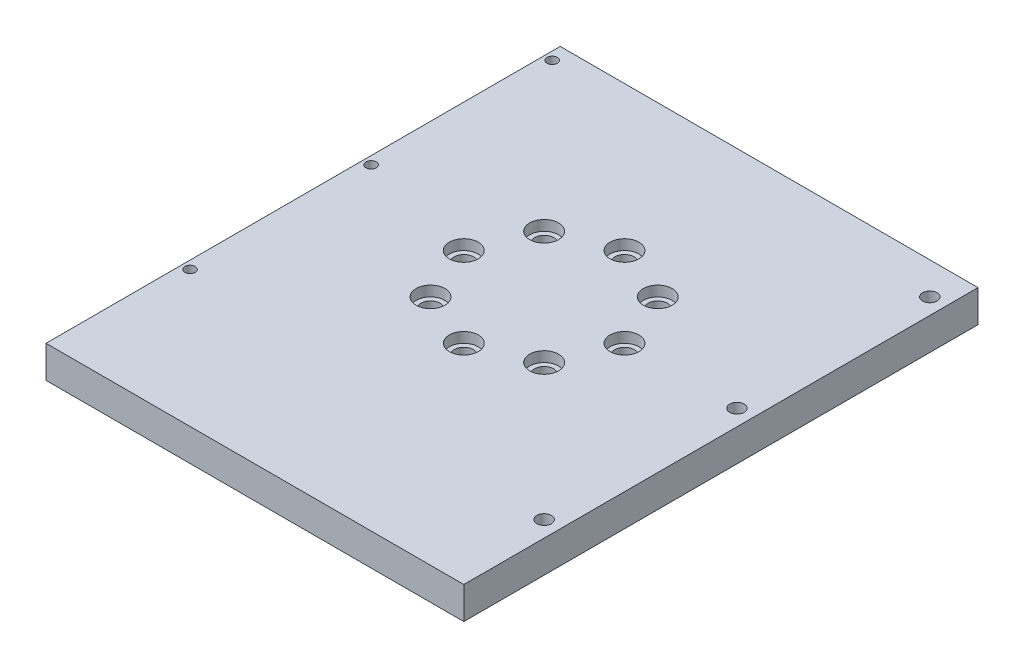
ISO-10303-21;
HEADER;
FILE_DESCRIPTION(('STEP AP214'),'2;1');
FILE_NAME('part.step','',(''),(''),'','','');
FILE_SCHEMA(('AUTOMOTIVE_DESIGN { 1 0 10303 214 1 1 1 1 }'));
ENDSEC;
DATA;
#1=APPLICATION_CONTEXT('core data for automotive mechanical design processes');
#2=APPLICATION_PROTOCOL_DEFINITION('international standard','automotive_design',2000,#1);
#3=PRODUCT_CONTEXT('',#1,'mechanical');
#4=PRODUCT('Part','Part','',(#3));
#5=PRODUCT_RELATED_PRODUCT_CATEGORY('part','',(#4));
#6=PRODUCT_DEFINITION_FORMATION('','',#4);
#7=PRODUCT_DEFINITION_CONTEXT('part definition',#1,'design');
#8=PRODUCT_DEFINITION('design','',#6,#7);
#9=PRODUCT_DEFINITION_SHAPE('','',#8);
#10=(LENGTH_UNIT() NAMED_UNIT(*) SI_UNIT(.MILLI.,.METRE.));
#11=(NAMED_UNIT(*) PLANE_ANGLE_UNIT() SI_UNIT($,.RADIAN.));
#12=(NAMED_UNIT(*) SI_UNIT($,.STERADIAN.) SOLID_ANGLE_UNIT());
#13=UNCERTAINTY_MEASURE_WITH_UNIT(LENGTH_MEASURE(1.E-05),#10,'distance_accuracy_value','');
#14=(GEOMETRIC_REPRESENTATION_CONTEXT(3) GLOBAL_UNCERTAINTY_ASSIGNED_CONTEXT((#13)) GLOBAL_UNIT_ASSIGNED_CONTEXT((#10,
#11,#12)) REPRESENTATION_CONTEXT('',''));
#15=CARTESIAN_POINT('',(0.,0.,0.));
#16=DIRECTION('',(0.,0.,1.));
#17=DIRECTION('',(1.,0.,0.));
#18=AXIS2_PLACEMENT_3D('',#15,#16,#17);
#19=CARTESIAN_POINT('',(0.,0.,0.));
#20=DIRECTION('',(0.,1.,0.));
#21=DIRECTION('',(0.,0.,1.));
#22=AXIS2_PLACEMENT_3D('',#19,#20,#21);
#23=PLANE('',#22);
#24=CARTESIAN_POINT('',(0.,0.,0.));
#25=DIRECTION('',(0.,1.,0.));
#26=DIRECTION('',(0.,0.,1.));
#27=AXIS2_PLACEMENT_3D('',#24,#25,#26);
#28=CIRCLE('',#27,45.);
#29=CARTESIAN_POINT('',(0.,0.,45.));
#30=VERTEX_POINT('',#29);
#31=EDGE_CURVE('E144',#30,#30,#28,.T.);
#32=ORIENTED_EDGE('',*,*,#31,.F.);
#33=EDGE_LOOP('',(#32));
#34=FACE_BOUND('',#33,.T.);
#35=CARTESIAN_POINT('',(17.6776695296651,0.,17.6776695296631));
#36=DIRECTION('',(0.,1.,0.));
#37=DIRECTION('',(0.,0.,1.));
#38=AXIS2_PLACEMENT_3D('',#35,#36,#37);
#39=CIRCLE('',#38,3.);
#40=CARTESIAN_POINT('',(17.6776695296651,0.,20.6776695296631));
#41=VERTEX_POINT('',#40);
#42=EDGE_CURVE('E259',#41,#41,#39,.T.);
#43=ORIENTED_EDGE('',*,*,#42,.T.);
#44=EDGE_LOOP('',(#43));
#45=FACE_BOUND('',#44,.T.);
#46=CARTESIAN_POINT('',(25.0000000000009,0.,-8.50508151013612E-13));
#47=DIRECTION('',(0.,1.,0.));
#48=DIRECTION('',(0.,0.,1.));
#49=AXIS2_PLACEMENT_3D('',#46,#47,#48);
#50=CIRCLE('',#49,3.);
#51=CARTESIAN_POINT('',(25.0000000000009,0.,2.99999999999915));
#52=VERTEX_POINT('',#51);
#53=EDGE_CURVE('E267',#52,#52,#50,.T.);
#54=ORIENTED_EDGE('',*,*,#53,.T.);
#55=EDGE_LOOP('',(#54));
#56=FACE_BOUND('',#55,.T.);
#57=CARTESIAN_POINT('',(17.6776695296639,0.,-17.6776695296643));
#58=DIRECTION('',(0.,1.,0.));
#59=DIRECTION('',(0.,0.,1.));
#60=AXIS2_PLACEMENT_3D('',#57,#58,#59);
#61=CIRCLE('',#60,3.);
#62=CARTESIAN_POINT('',(17.6776695296639,0.,-14.6776695296643));
#63=VERTEX_POINT('',#62);
#64=EDGE_CURVE('E273',#63,#63,#61,.T.);
#65=ORIENTED_EDGE('',*,*,#64,.T.);
#66=EDGE_LOOP('',(#65));
#67=FACE_BOUND('',#66,.T.);
#68=CARTESIAN_POINT('',(0.,0.,-25.));
#69=DIRECTION('',(0.,1.,0.));
#70=DIRECTION('',(0.,0.,1.));
#71=AXIS2_PLACEMENT_3D('',#68,#69,#70);
#72=CIRCLE('',#71,3.);
#73=CARTESIAN_POINT('',(0.,0.,-22.));
#74=VERTEX_POINT('',#73);
#75=EDGE_CURVE('E279',#74,#74,#72,.T.);
#76=ORIENTED_EDGE('',*,*,#75,.T.);
#77=EDGE_LOOP('',(#76));
#78=FACE_BOUND('',#77,.T.);
#79=CARTESIAN_POINT('',(-17.6776695296634,0.,-17.6776695296631));
#80=DIRECTION('',(0.,1.,0.));
#81=DIRECTION('',(0.,0.,1.));
#82=AXIS2_PLACEMENT_3D('',#79,#80,#81);
#83=CIRCLE('',#82,3.);
#84=CARTESIAN_POINT('',(-17.6776695296634,0.,-14.6776695296631));
#85=VERTEX_POINT('',#84);
#86=EDGE_CURVE('E285',#85,#85,#83,.T.);
#87=ORIENTED_EDGE('',*,*,#86,.T.);
#88=EDGE_LOOP('',(#87));
#89=FACE_BOUND('',#88,.T.);
#90=CARTESIAN_POINT('',(-24.9999999999992,0.,8.53569768011481E-13));
#91=DIRECTION('',(0.,1.,0.));
#92=DIRECTION('',(0.,0.,1.));
#93=AXIS2_PLACEMENT_3D('',#90,#91,#92);
#94=CIRCLE('',#93,3.);
#95=CARTESIAN_POINT('',(-24.9999999999992,0.,3.00000000000085));
#96=VERTEX_POINT('',#95);
#97=EDGE_CURVE('E291',#96,#96,#94,.T.);
#98=ORIENTED_EDGE('',*,*,#97,.T.);
#99=EDGE_LOOP('',(#98));
#100=FACE_BOUND('',#99,.T.);
#101=CARTESIAN_POINT('',(-17.6776695296622,0.,17.6776695296643));
#102=DIRECTION('',(0.,1.,0.));
#103=DIRECTION('',(0.,0.,1.));
#104=AXIS2_PLACEMENT_3D('',#101,#102,#103);
#105=CIRCLE('',#104,3.);
#106=CARTESIAN_POINT('',(-17.6776695296622,0.,20.6776695296643));
#107=VERTEX_POINT('',#106);
#108=EDGE_CURVE('E297',#107,#107,#105,.T.);
#109=ORIENTED_EDGE('',*,*,#108,.T.);
#110=EDGE_LOOP('',(#109));
#111=FACE_BOUND('',#110,.T.);
#112=CARTESIAN_POINT('',(1.70101630202722E-12,0.,25.));
#113=DIRECTION('',(0.,1.,0.));
#114=DIRECTION('',(0.,0.,1.));
#115=AXIS2_PLACEMENT_3D('',#112,#113,#114);
#116=CIRCLE('',#115,3.);
#117=CARTESIAN_POINT('',(1.70101630202722E-12,0.,28.));
#118=VERTEX_POINT('',#117);
#119=EDGE_CURVE('E303',#118,#118,#116,.T.);
#120=ORIENTED_EDGE('',*,*,#119,.T.);
#121=EDGE_LOOP('',(#120));
#122=FACE_BOUND('',#121,.T.);
#123=ADVANCED_FACE('F40',(#34,#45,#56,#67,#78,#89,#100,#111,#122),#23,.F.);
#124=CARTESIAN_POINT('',(65.,10.,0.));
#125=DIRECTION('',(1.,0.,0.));
#126=DIRECTION('',(0.,0.,-1.));
#127=AXIS2_PLACEMENT_3D('',#124,#125,#126);
#128=PLANE('',#127);
#129=DIRECTION('',(0.,0.,1.));
#130=VECTOR('',#129,1.);
#131=CARTESIAN_POINT('',(65.,0.,0.));
#132=LINE('',#131,#130);
#133=CARTESIAN_POINT('',(65.,0.,-70.));
#134=VERTEX_POINT('',#133);
#135=CARTESIAN_POINT('',(65.,0.,90.));
#136=VERTEX_POINT('',#135);
#137=EDGE_CURVE('E134',#134,#136,#132,.T.);
#138=ORIENTED_EDGE('',*,*,#137,.F.);
#139=DIRECTION('',(0.,-1.,0.));
#140=VECTOR('',#139,1.);
#141=CARTESIAN_POINT('',(65.,10.,-70.));
#142=LINE('',#141,#140);
#143=CARTESIAN_POINT('',(65.,10.,-70.));
#144=VERTEX_POINT('',#143);
#145=EDGE_CURVE('E84',#144,#134,#142,.T.);
#146=ORIENTED_EDGE('',*,*,#145,.F.);
#147=DIRECTION('',(0.,0.,1.));
#148=VECTOR('',#147,1.);
#149=CARTESIAN_POINT('',(65.,10.,0.));
#150=LINE('',#149,#148);
#151=CARTESIAN_POINT('',(65.,10.,90.));
#152=VERTEX_POINT('',#151);
#153=EDGE_CURVE('E103',#144,#152,#150,.T.);
#154=ORIENTED_EDGE('',*,*,#153,.T.);
#155=DIRECTION('',(0.,-1.,0.));
#156=VECTOR('',#155,1.);
#157=CARTESIAN_POINT('',(65.,10.,90.));
#158=LINE('',#157,#156);
#159=EDGE_CURVE('E80',#152,#136,#158,.T.);
#160=ORIENTED_EDGE('',*,*,#159,.T.);
#161=EDGE_LOOP('',(#138,#146,#154,#160));
#162=FACE_BOUND('',#161,.T.);
#163=ADVANCED_FACE('F42',(#162),#128,.T.);
#164=CARTESIAN_POINT('',(0.,10.,-70.));
#165=DIRECTION('',(0.,0.,-1.));
#166=DIRECTION('',(-1.,0.,0.));
#167=AXIS2_PLACEMENT_3D('',#164,#165,#166);
#168=PLANE('',#167);
#169=DIRECTION('',(1.,0.,0.));
#170=VECTOR('',#169,1.);
#171=CARTESIAN_POINT('',(0.,0.,-70.));
#172=LINE('',#171,#170);
#173=CARTESIAN_POINT('',(-65.,0.,-70.));
#174=VERTEX_POINT('',#173);
#175=EDGE_CURVE('E95',#174,#134,#172,.T.);
#176=ORIENTED_EDGE('',*,*,#175,.F.);
#177=DIRECTION('',(0.,-1.,0.));
#178=VECTOR('',#177,1.);
#179=CARTESIAN_POINT('',(-65.,10.,-70.));
#180=LINE('',#179,#178);
#181=CARTESIAN_POINT('',(-65.,10.,-70.));
#182=VERTEX_POINT('',#181);
#183=EDGE_CURVE('E89',#182,#174,#180,.T.);
#184=ORIENTED_EDGE('',*,*,#183,.F.);
#185=DIRECTION('',(1.,0.,0.));
#186=VECTOR('',#185,1.);
#187=CARTESIAN_POINT('',(0.,10.,-70.));
#188=LINE('',#187,#186);
#189=EDGE_CURVE('E93',#182,#144,#188,.T.);
#190=ORIENTED_EDGE('',*,*,#189,.T.);
#191=ORIENTED_EDGE('',*,*,#145,.T.);
#192=EDGE_LOOP('',(#176,#184,#190,#191));
#193=FACE_BOUND('',#192,.T.);
#194=ADVANCED_FACE('F91',(#193),#168,.T.);
#195=CARTESIAN_POINT('',(-65.,10.,0.));
#196=DIRECTION('',(1.,0.,0.));
#197=DIRECTION('',(0.,0.,-1.));
#198=AXIS2_PLACEMENT_3D('',#195,#196,#197);
#199=PLANE('',#198);
#200=DIRECTION('',(0.,0.,1.));
#201=VECTOR('',#200,1.);
#202=CARTESIAN_POINT('',(-65.,0.,0.));
#203=LINE('',#202,#201);
#204=CARTESIAN_POINT('',(-65.,0.,90.));
#205=VERTEX_POINT('',#204);
#206=EDGE_CURVE('E73',#174,#205,#203,.T.);
#207=ORIENTED_EDGE('',*,*,#206,.T.);
#208=DIRECTION('',(0.,-1.,0.));
#209=VECTOR('',#208,1.);
#210=CARTESIAN_POINT('',(-65.,10.,90.));
#211=LINE('',#210,#209);
#212=CARTESIAN_POINT('',(-65.,10.,90.));
#213=VERTEX_POINT('',#212);
#214=EDGE_CURVE('E96',#213,#205,#211,.T.);
#215=ORIENTED_EDGE('',*,*,#214,.F.);
#216=DIRECTION('',(0.,0.,1.));
#217=VECTOR('',#216,1.);
#218=CARTESIAN_POINT('',(-65.,10.,0.));
#219=LINE('',#218,#217);
#220=EDGE_CURVE('E98',#182,#213,#219,.T.);
#221=ORIENTED_EDGE('',*,*,#220,.F.);
#222=ORIENTED_EDGE('',*,*,#183,.T.);
#223=EDGE_LOOP('',(#207,#215,#221,#222));
#224=FACE_BOUND('',#223,.T.);
#225=ADVANCED_FACE('F99',(#224),#199,.F.);
#226=CARTESIAN_POINT('',(17.6776695296637,10.,-17.6776695296637));
#227=DIRECTION('',(0.,-1.,0.));
#228=DIRECTION('',(0.,0.,-1.));
#229=AXIS2_PLACEMENT_3D('',#226,#227,#228);
#230=CYLINDRICAL_SURFACE('',#229,4.5);
#231=CARTESIAN_POINT('',(17.6776695296637,6.8,-17.6776695296637));
#232=DIRECTION('',(0.,1.,0.));
#233=DIRECTION('',(0.,0.,1.));
#234=AXIS2_PLACEMENT_3D('',#231,#232,#233);
#235=CIRCLE('',#234,4.5);
#236=CARTESIAN_POINT('',(17.6776695296637,6.8,-13.1776695296637));
#237=VERTEX_POINT('',#236);
#238=EDGE_CURVE('E153',#237,#237,#235,.T.);
#239=ORIENTED_EDGE('',*,*,#238,.F.);
#240=EDGE_LOOP('',(#239));
#241=FACE_BOUND('',#240,.T.);
#242=CARTESIAN_POINT('',(17.6776695296637,10.,-17.6776695296637));
#243=DIRECTION('',(0.,1.,0.));
#244=DIRECTION('',(0.,0.,1.));
#245=AXIS2_PLACEMENT_3D('',#242,#243,#244);
#246=CIRCLE('',#245,4.5);
#247=CARTESIAN_POINT('',(17.6776695296637,10.,-13.1776695296637));
#248=VERTEX_POINT('',#247);
#249=EDGE_CURVE('E128',#248,#248,#246,.T.);
#250=ORIENTED_EDGE('',*,*,#249,.T.);
#251=EDGE_LOOP('',(#250));
#252=FACE_BOUND('',#251,.T.);
#253=ADVANCED_FACE('F571',(#241,#252),#230,.F.);
#254=CARTESIAN_POINT('',(25.,10.,0.));
#255=DIRECTION('',(0.,-1.,0.));
#256=DIRECTION('',(0.,0.,-1.));
#257=AXIS2_PLACEMENT_3D('',#254,#255,#256);
#258=CYLINDRICAL_SURFACE('',#257,4.5);
#259=CARTESIAN_POINT('',(25.,6.8,0.));
#260=DIRECTION('',(0.,1.,0.));
#261=DIRECTION('',(0.,0.,1.));
#262=AXIS2_PLACEMENT_3D('',#259,#260,#261);
#263=CIRCLE('',#262,4.5);
#264=CARTESIAN_POINT('',(25.,6.8,4.50000000000009));
#265=VERTEX_POINT('',#264);
#266=EDGE_CURVE('E150',#265,#265,#263,.T.);
#267=ORIENTED_EDGE('',*,*,#266,.F.);
#268=EDGE_LOOP('',(#267));
#269=FACE_BOUND('',#268,.T.);
#270=CARTESIAN_POINT('',(25.,10.,0.));
#271=DIRECTION('',(0.,1.,0.));
#272=DIRECTION('',(0.,0.,1.));
#273=AXIS2_PLACEMENT_3D('',#270,#271,#272);
#274=CIRCLE('',#273,4.5);
#275=CARTESIAN_POINT('',(25.,10.,4.50000000000009));
#276=VERTEX_POINT('',#275);
#277=EDGE_CURVE('E125',#276,#276,#274,.T.);
#278=ORIENTED_EDGE('',*,*,#277,.T.);
#279=EDGE_LOOP('',(#278));
#280=FACE_BOUND('',#279,.T.);
#281=ADVANCED_FACE('F605',(#269,#280),#258,.F.);
#282=CARTESIAN_POINT('',(17.6776695296655,10.,17.6776695296629));
#283=DIRECTION('',(0.,-1.,0.));
#284=DIRECTION('',(0.,0.,-1.));
#285=AXIS2_PLACEMENT_3D('',#282,#283,#284);
#286=CYLINDRICAL_SURFACE('',#285,4.50000000000195);
#287=CARTESIAN_POINT('',(17.6776695296655,6.8,17.6776695296629));
#288=DIRECTION('',(0.,1.,0.));
#289=DIRECTION('',(0.,0.,1.));
#290=AXIS2_PLACEMENT_3D('',#287,#288,#289);
#291=CIRCLE('',#290,4.50000000000195);
#292=CARTESIAN_POINT('',(17.6776695296655,6.8,22.1776695296649));
#293=VERTEX_POINT('',#292);
#294=EDGE_CURVE('E147',#293,#293,#291,.T.);
#295=ORIENTED_EDGE('',*,*,#294,.F.);
#296=EDGE_LOOP('',(#295));
#297=FACE_BOUND('',#296,.T.);
#298=CARTESIAN_POINT('',(17.6776695296655,10.,17.6776695296629));
#299=DIRECTION('',(0.,1.,0.));
#300=DIRECTION('',(0.,0.,1.));
#301=AXIS2_PLACEMENT_3D('',#298,#299,#300);
#302=CIRCLE('',#301,4.50000000000195);
#303=CARTESIAN_POINT('',(17.6776695296655,10.,22.1776695296649));
#304=VERTEX_POINT('',#303);
#305=EDGE_CURVE('E122',#304,#304,#302,.T.);
#306=ORIENTED_EDGE('',*,*,#305,.T.);
#307=EDGE_LOOP('',(#306));
#308=FACE_BOUND('',#307,.T.);
#309=ADVANCED_FACE('F601',(#297,#308),#286,.F.);
#310=CARTESIAN_POINT('',(2.12550497328456E-12,10.,25.));
#311=DIRECTION('',(0.,-1.,0.));
#312=DIRECTION('',(0.,0.,-1.));
#313=AXIS2_PLACEMENT_3D('',#310,#311,#312);
#314=CYLINDRICAL_SURFACE('',#313,4.5000000000023);
#315=CARTESIAN_POINT('',(2.12550497328456E-12,6.8,25.));
#316=DIRECTION('',(0.,1.,0.));
#317=DIRECTION('',(0.,0.,1.));
#318=AXIS2_PLACEMENT_3D('',#315,#316,#317);
#319=CIRCLE('',#318,4.5000000000023);
#320=CARTESIAN_POINT('',(2.12550497328456E-12,6.8,29.5000000000023));
#321=VERTEX_POINT('',#320);
#322=EDGE_CURVE('E11',#321,#321,#319,.T.);
#323=ORIENTED_EDGE('',*,*,#322,.F.);
#324=EDGE_LOOP('',(#323));
#325=FACE_BOUND('',#324,.T.);
#326=CARTESIAN_POINT('',(2.12550497328456E-12,10.,25.));
#327=DIRECTION('',(0.,1.,0.));
#328=DIRECTION('',(0.,0.,1.));
#329=AXIS2_PLACEMENT_3D('',#326,#327,#328);
#330=CIRCLE('',#329,4.5000000000023);
#331=CARTESIAN_POINT('',(2.12550497328456E-12,10.,29.5000000000023));
#332=VERTEX_POINT('',#331);
#333=EDGE_CURVE('E119',#332,#332,#330,.T.);
#334=ORIENTED_EDGE('',*,*,#333,.T.);
#335=EDGE_LOOP('',(#334));
#336=FACE_BOUND('',#335,.T.);
#337=ADVANCED_FACE('F173',(#325,#336),#314,.F.);
#338=CARTESIAN_POINT('',(-17.6776695296619,10.,17.6776695296644));
#339=DIRECTION('',(0.,-1.,0.));
#340=DIRECTION('',(0.,0.,-1.));
#341=AXIS2_PLACEMENT_3D('',#338,#339,#340);
#342=CYLINDRICAL_SURFACE('',#341,4.50000000000203);
#343=CARTESIAN_POINT('',(-17.6776695296619,6.8,17.6776695296644));
#344=DIRECTION('',(0.,1.,0.));
#345=DIRECTION('',(0.,0.,1.));
#346=AXIS2_PLACEMENT_3D('',#343,#344,#345);
#347=CIRCLE('',#346,4.50000000000203);
#348=CARTESIAN_POINT('',(-17.6776695296619,6.8,22.1776695296665));
#349=VERTEX_POINT('',#348);
#350=EDGE_CURVE('E49',#349,#349,#347,.T.);
#351=ORIENTED_EDGE('',*,*,#350,.F.);
#352=EDGE_LOOP('',(#351));
#353=FACE_BOUND('',#352,.T.);
#354=CARTESIAN_POINT('',(-17.6776695296619,10.,17.6776695296644));
#355=DIRECTION('',(0.,1.,0.));
#356=DIRECTION('',(0.,0.,1.));
#357=AXIS2_PLACEMENT_3D('',#354,#355,#356);
#358=CIRCLE('',#357,4.50000000000203);
#359=CARTESIAN_POINT('',(-17.6776695296619,10.,22.1776695296665));
#360=VERTEX_POINT('',#359);
#361=EDGE_CURVE('E116',#360,#360,#358,.T.);
#362=ORIENTED_EDGE('',*,*,#361,.T.);
#363=EDGE_LOOP('',(#362));
#364=FACE_BOUND('',#363,.T.);
#365=ADVANCED_FACE('F169',(#353,#364),#342,.F.);
#366=CARTESIAN_POINT('',(-25.,10.,-2.61861100413235E-13));
#367=DIRECTION('',(0.,-1.,0.));
#368=DIRECTION('',(0.,0.,-1.));
#369=AXIS2_PLACEMENT_3D('',#366,#367,#368);
#370=CYLINDRICAL_SURFACE('',#369,4.5);
#371=CARTESIAN_POINT('',(-25.,6.8,-2.61861100413235E-13));
#372=DIRECTION('',(0.,1.,0.));
#373=DIRECTION('',(0.,0.,1.));
#374=AXIS2_PLACEMENT_3D('',#371,#372,#373);
#375=CIRCLE('',#374,4.5);
#376=CARTESIAN_POINT('',(-25.,6.8,4.49999999999974));
#377=VERTEX_POINT('',#376);
#378=EDGE_CURVE('E162',#377,#377,#375,.T.);
#379=ORIENTED_EDGE('',*,*,#378,.F.);
#380=EDGE_LOOP('',(#379));
#381=FACE_BOUND('',#380,.T.);
#382=CARTESIAN_POINT('',(-25.,10.,-2.61861100413235E-13));
#383=DIRECTION('',(0.,1.,0.));
#384=DIRECTION('',(0.,0.,1.));
#385=AXIS2_PLACEMENT_3D('',#382,#383,#384);
#386=CIRCLE('',#385,4.5);
#387=CARTESIAN_POINT('',(-25.,10.,4.49999999999974));
#388=VERTEX_POINT('',#387);
#389=EDGE_CURVE('E113',#388,#388,#386,.T.);
#390=ORIENTED_EDGE('',*,*,#389,.T.);
#391=EDGE_LOOP('',(#390));
#392=FACE_BOUND('',#391,.T.);
#393=ADVANCED_FACE('F172',(#381,#392),#370,.F.);
#394=CARTESIAN_POINT('',(-17.6776695296635,10.,-17.6776695296639));
#395=DIRECTION('',(0.,-1.,0.));
#396=DIRECTION('',(0.,0.,-1.));
#397=AXIS2_PLACEMENT_3D('',#394,#395,#396);
#398=CYLINDRICAL_SURFACE('',#397,4.5);
#399=CARTESIAN_POINT('',(-17.6776695296635,6.8,-17.6776695296639));
#400=DIRECTION('',(0.,1.,0.));
#401=DIRECTION('',(0.,0.,1.));
#402=AXIS2_PLACEMENT_3D('',#399,#400,#401);
#403=CIRCLE('',#402,4.5);
#404=CARTESIAN_POINT('',(-17.6776695296635,6.8,-13.1776695296639));
#405=VERTEX_POINT('',#404);
#406=EDGE_CURVE('E159',#405,#405,#403,.T.);
#407=ORIENTED_EDGE('',*,*,#406,.F.);
#408=EDGE_LOOP('',(#407));
#409=FACE_BOUND('',#408,.T.);
#410=CARTESIAN_POINT('',(-17.6776695296635,10.,-17.6776695296639));
#411=DIRECTION('',(0.,1.,0.));
#412=DIRECTION('',(0.,0.,1.));
#413=AXIS2_PLACEMENT_3D('',#410,#411,#412);
#414=CIRCLE('',#413,4.5);
#415=CARTESIAN_POINT('',(-17.6776695296635,10.,-13.1776695296639));
#416=VERTEX_POINT('',#415);
#417=EDGE_CURVE('E110',#416,#416,#414,.T.);
#418=ORIENTED_EDGE('',*,*,#417,.T.);
#419=EDGE_LOOP('',(#418));
#420=FACE_BOUND('',#419,.T.);
#421=ADVANCED_FACE('F201',(#409,#420),#398,.F.);
#422=CARTESIAN_POINT('',(0.,10.,90.));
#423=DIRECTION('',(0.,0.,-1.));
#424=DIRECTION('',(-1.,0.,0.));
#425=AXIS2_PLACEMENT_3D('',#422,#423,#424);
#426=PLANE('',#425);
#427=DIRECTION('',(1.,0.,0.));
#428=VECTOR('',#427,1.);
#429=CARTESIAN_POINT('',(0.,0.,90.));
#430=LINE('',#429,#428);
#431=EDGE_CURVE('E105',#205,#136,#430,.T.);
#432=ORIENTED_EDGE('',*,*,#431,.T.);
#433=ORIENTED_EDGE('',*,*,#159,.F.);
#434=DIRECTION('',(1.,0.,0.));
#435=VECTOR('',#434,1.);
#436=CARTESIAN_POINT('',(0.,10.,90.));
#437=LINE('',#436,#435);
#438=EDGE_CURVE('E57',#213,#152,#437,.T.);
#439=ORIENTED_EDGE('',*,*,#438,.F.);
#440=ORIENTED_EDGE('',*,*,#214,.T.);
#441=EDGE_LOOP('',(#432,#433,#439,#440));
#442=FACE_BOUND('',#441,.T.);
#443=ADVANCED_FACE('F194',(#442),#426,.F.);
#444=CARTESIAN_POINT('',(0.,10.,-25.));
#445=DIRECTION('',(0.,-1.,0.));
#446=DIRECTION('',(0.,0.,-1.));
#447=AXIS2_PLACEMENT_3D('',#444,#445,#446);
#448=CYLINDRICAL_SURFACE('',#447,4.5);
#449=CARTESIAN_POINT('',(0.,6.8,-25.));
#450=DIRECTION('',(0.,1.,0.));
#451=DIRECTION('',(0.,0.,1.));
#452=AXIS2_PLACEMENT_3D('',#449,#450,#451);
#453=CIRCLE('',#452,4.5);
#454=CARTESIAN_POINT('',(0.,6.8,-20.5));
#455=VERTEX_POINT('',#454);
#456=EDGE_CURVE('E156',#455,#455,#453,.T.);
#457=ORIENTED_EDGE('',*,*,#456,.F.);
#458=EDGE_LOOP('',(#457));
#459=FACE_BOUND('',#458,.T.);
#460=CARTESIAN_POINT('',(0.,10.,-25.));
#461=DIRECTION('',(0.,1.,0.));
#462=DIRECTION('',(0.,0.,1.));
#463=AXIS2_PLACEMENT_3D('',#460,#461,#462);
#464=CIRCLE('',#463,4.5);
#465=CARTESIAN_POINT('',(0.,10.,-20.5));
#466=VERTEX_POINT('',#465);
#467=EDGE_CURVE('E131',#466,#466,#464,.T.);
#468=ORIENTED_EDGE('',*,*,#467,.T.);
#469=EDGE_LOOP('',(#468));
#470=FACE_BOUND('',#469,.T.);
#471=ADVANCED_FACE('F180',(#459,#470),#448,.F.);
#472=CARTESIAN_POINT('',(0.,10.,0.));
#473=DIRECTION('',(0.,1.,0.));
#474=DIRECTION('',(0.,0.,1.));
#475=AXIS2_PLACEMENT_3D('',#472,#473,#474);
#476=PLANE('',#475);
#477=CARTESIAN_POINT('',(60.,10.,-60.));
#478=DIRECTION('',(0.,1.,0.));
#479=DIRECTION('',(0.,0.,1.));
#480=AXIS2_PLACEMENT_3D('',#477,#478,#479);
#481=CIRCLE('',#480,2.25);
#482=CARTESIAN_POINT('',(60.,10.,-57.75));
#483=VERTEX_POINT('',#482);
#484=EDGE_CURVE('E328',#483,#483,#481,.T.);
#485=ORIENTED_EDGE('',*,*,#484,.F.);
#486=EDGE_LOOP('',(#485));
#487=FACE_BOUND('',#486,.T.);
#488=CARTESIAN_POINT('',(60.,10.,0.));
#489=DIRECTION('',(0.,1.,0.));
#490=DIRECTION('',(0.,0.,1.));
#491=AXIS2_PLACEMENT_3D('',#488,#489,#490);
#492=CIRCLE('',#491,2.25);
#493=CARTESIAN_POINT('',(60.,10.,2.25));
#494=VERTEX_POINT('',#493);
#495=EDGE_CURVE('E324',#494,#494,#492,.T.);
#496=ORIENTED_EDGE('',*,*,#495,.F.);
#497=EDGE_LOOP('',(#496));
#498=FACE_BOUND('',#497,.T.);
#499=CARTESIAN_POINT('',(60.,10.,60.));
#500=DIRECTION('',(0.,1.,0.));
#501=DIRECTION('',(0.,0.,-1.));
#502=AXIS2_PLACEMENT_3D('',#499,#500,#501);
#503=CIRCLE('',#502,2.25);
#504=CARTESIAN_POINT('',(60.,10.,57.75));
#505=VERTEX_POINT('',#504);
#506=EDGE_CURVE('E320',#505,#505,#503,.T.);
#507=ORIENTED_EDGE('',*,*,#506,.F.);
#508=EDGE_LOOP('',(#507));
#509=FACE_BOUND('',#508,.T.);
#510=CARTESIAN_POINT('',(-62.5,10.,-65.));
#511=DIRECTION('',(0.,1.,0.));
#512=DIRECTION('',(0.,0.,1.));
#513=AXIS2_PLACEMENT_3D('',#510,#511,#512);
#514=CIRCLE('',#513,1.60000000000001);
#515=CARTESIAN_POINT('',(-62.5,10.,-63.4));
#516=VERTEX_POINT('',#515);
#517=EDGE_CURVE('E316',#516,#516,#514,.T.);
#518=ORIENTED_EDGE('',*,*,#517,.F.);
#519=EDGE_LOOP('',(#518));
#520=FACE_BOUND('',#519,.T.);
#521=CARTESIAN_POINT('',(-62.5,10.,-8.65500000000001));
#522=DIRECTION('',(0.,1.,0.));
#523=DIRECTION('',(0.,0.,1.));
#524=AXIS2_PLACEMENT_3D('',#521,#522,#523);
#525=CIRCLE('',#524,1.6);
#526=CARTESIAN_POINT('',(-62.5,10.,-7.05500000000001));
#527=VERTEX_POINT('',#526);
#528=EDGE_CURVE('E312',#527,#527,#525,.T.);
#529=ORIENTED_EDGE('',*,*,#528,.F.);
#530=EDGE_LOOP('',(#529));
#531=FACE_BOUND('',#530,.T.);
#532=CARTESIAN_POINT('',(-62.5,10.,47.69));
#533=DIRECTION('',(0.,1.,0.));
#534=DIRECTION('',(0.,0.,-1.));
#535=AXIS2_PLACEMENT_3D('',#532,#533,#534);
#536=CIRCLE('',#535,1.60000000000001);
#537=CARTESIAN_POINT('',(-62.5,10.,46.09));
#538=VERTEX_POINT('',#537);
#539=EDGE_CURVE('E308',#538,#538,#536,.T.);
#540=ORIENTED_EDGE('',*,*,#539,.F.);
#541=EDGE_LOOP('',(#540));
#542=FACE_BOUND('',#541,.T.);
#543=ORIENTED_EDGE('',*,*,#153,.F.);
#544=ORIENTED_EDGE('',*,*,#189,.F.);
#545=ORIENTED_EDGE('',*,*,#220,.T.);
#546=ORIENTED_EDGE('',*,*,#438,.T.);
#547=EDGE_LOOP('',(#543,#544,#545,#546));
#548=FACE_BOUND('',#547,.T.);
#549=ORIENTED_EDGE('',*,*,#417,.F.);
#550=EDGE_LOOP('',(#549));
#551=FACE_BOUND('',#550,.T.);
#552=ORIENTED_EDGE('',*,*,#389,.F.);
#553=EDGE_LOOP('',(#552));
#554=FACE_BOUND('',#553,.T.);
#555=ORIENTED_EDGE('',*,*,#361,.F.);
#556=EDGE_LOOP('',(#555));
#557=FACE_BOUND('',#556,.T.);
#558=ORIENTED_EDGE('',*,*,#333,.F.);
#559=EDGE_LOOP('',(#558));
#560=FACE_BOUND('',#559,.T.);
#561=ORIENTED_EDGE('',*,*,#305,.F.);
#562=EDGE_LOOP('',(#561));
#563=FACE_BOUND('',#562,.T.);
#564=ORIENTED_EDGE('',*,*,#277,.F.);
#565=EDGE_LOOP('',(#564));
#566=FACE_BOUND('',#565,.T.);
#567=ORIENTED_EDGE('',*,*,#249,.F.);
#568=EDGE_LOOP('',(#567));
#569=FACE_BOUND('',#568,.T.);
#570=ORIENTED_EDGE('',*,*,#467,.F.);
#571=EDGE_LOOP('',(#570));
#572=FACE_BOUND('',#571,.T.);
#573=ADVANCED_FACE('F101',(#487,#498,#509,#520,#531,#542,#548,#551,#554,#557,#560,#563,#566,
#569,#572),#476,.T.);
#574=CARTESIAN_POINT('',(60.,0.,-60.));
#575=DIRECTION('',(0.,1.,0.));
#576=DIRECTION('',(0.,0.,1.));
#577=AXIS2_PLACEMENT_3D('',#574,#575,#576);
#578=CIRCLE('',#577,2.25);
#579=CARTESIAN_POINT('',(60.,0.,-57.75));
#580=VERTEX_POINT('',#579);
#581=EDGE_CURVE('E227',#580,#580,#578,.T.);
#582=ORIENTED_EDGE('',*,*,#581,.T.);
#583=EDGE_LOOP('',(#582));
#584=FACE_BOUND('',#583,.T.);
#585=CARTESIAN_POINT('',(60.,0.,0.));
#586=DIRECTION('',(0.,1.,0.));
#587=DIRECTION('',(0.,0.,1.));
#588=AXIS2_PLACEMENT_3D('',#585,#586,#587);
#589=CIRCLE('',#588,2.25);
#590=CARTESIAN_POINT('',(60.,0.,2.25));
#591=VERTEX_POINT('',#590);
#592=EDGE_CURVE('E231',#591,#591,#589,.T.);
#593=ORIENTED_EDGE('',*,*,#592,.T.);
#594=EDGE_LOOP('',(#593));
#595=FACE_BOUND('',#594,.T.);
#596=CARTESIAN_POINT('',(60.,0.,60.));
#597=DIRECTION('',(0.,1.,0.));
#598=DIRECTION('',(0.,0.,-1.));
#599=AXIS2_PLACEMENT_3D('',#596,#597,#598);
#600=CIRCLE('',#599,2.25);
#601=CARTESIAN_POINT('',(60.,0.,57.75));
#602=VERTEX_POINT('',#601);
#603=EDGE_CURVE('E235',#602,#602,#600,.T.);
#604=ORIENTED_EDGE('',*,*,#603,.T.);
#605=EDGE_LOOP('',(#604));
#606=FACE_BOUND('',#605,.T.);
#607=CARTESIAN_POINT('',(-62.5,0.,-65.));
#608=DIRECTION('',(0.,1.,0.));
#609=DIRECTION('',(0.,0.,1.));
#610=AXIS2_PLACEMENT_3D('',#607,#608,#609);
#611=CIRCLE('',#610,1.60000000000001);
#612=CARTESIAN_POINT('',(-62.5,0.,-63.4));
#613=VERTEX_POINT('',#612);
#614=EDGE_CURVE('E239',#613,#613,#611,.T.);
#615=ORIENTED_EDGE('',*,*,#614,.T.);
#616=EDGE_LOOP('',(#615));
#617=FACE_BOUND('',#616,.T.);
#618=CARTESIAN_POINT('',(-62.5,0.,-8.65500000000001));
#619=DIRECTION('',(0.,1.,0.));
#620=DIRECTION('',(0.,0.,1.));
#621=AXIS2_PLACEMENT_3D('',#618,#619,#620);
#622=CIRCLE('',#621,1.6);
#623=CARTESIAN_POINT('',(-62.5,0.,-7.05500000000001));
#624=VERTEX_POINT('',#623);
#625=EDGE_CURVE('E243',#624,#624,#622,.T.);
#626=ORIENTED_EDGE('',*,*,#625,.T.);
#627=EDGE_LOOP('',(#626));
#628=FACE_BOUND('',#627,.T.);
#629=CARTESIAN_POINT('',(-62.5,0.,47.69));
#630=DIRECTION('',(0.,1.,0.));
#631=DIRECTION('',(0.,0.,-1.));
#632=AXIS2_PLACEMENT_3D('',#629,#630,#631);
#633=CIRCLE('',#632,1.60000000000001);
#634=CARTESIAN_POINT('',(-62.5,0.,46.09));
#635=VERTEX_POINT('',#634);
#636=EDGE_CURVE('E247',#635,#635,#633,.T.);
#637=ORIENTED_EDGE('',*,*,#636,.T.);
#638=EDGE_LOOP('',(#637));
#639=FACE_BOUND('',#638,.T.);
#640=CARTESIAN_POINT('',(0.,0.,0.));
#641=DIRECTION('',(0.,1.,0.));
#642=DIRECTION('',(0.,0.,1.));
#643=AXIS2_PLACEMENT_3D('',#640,#641,#642);
#644=CIRCLE('',#643,55.);
#645=CARTESIAN_POINT('',(0.,0.,55.));
#646=VERTEX_POINT('',#645);
#647=EDGE_CURVE('E251',#646,#646,#644,.T.);
#648=ORIENTED_EDGE('',*,*,#647,.T.);
#649=EDGE_LOOP('',(#648));
#650=FACE_BOUND('',#649,.T.);
#651=ORIENTED_EDGE('',*,*,#137,.T.);
#652=ORIENTED_EDGE('',*,*,#431,.F.);
#653=ORIENTED_EDGE('',*,*,#206,.F.);
#654=ORIENTED_EDGE('',*,*,#175,.T.);
#655=EDGE_LOOP('',(#651,#652,#653,#654));
#656=FACE_BOUND('',#655,.T.);
#657=ADVANCED_FACE('F179',(#584,#595,#606,#617,#628,#639,#650,#656),#23,.F.);
#658=CARTESIAN_POINT('',(0.,-5.,0.));
#659=DIRECTION('',(0.,1.,0.));
#660=DIRECTION('',(0.,0.,1.));
#661=AXIS2_PLACEMENT_3D('',#658,#659,#660);
#662=CYLINDRICAL_SURFACE('',#661,45.);
#663=CARTESIAN_POINT('',(0.,-5.,0.));
#664=DIRECTION('',(0.,1.,0.));
#665=DIRECTION('',(0.,0.,1.));
#666=AXIS2_PLACEMENT_3D('',#663,#664,#665);
#667=CIRCLE('',#666,45.);
#668=CARTESIAN_POINT('',(0.,-5.,45.));
#669=VERTEX_POINT('',#668);
#670=EDGE_CURVE('E254',#669,#669,#667,.T.);
#671=ORIENTED_EDGE('',*,*,#670,.F.);
#672=EDGE_LOOP('',(#671));
#673=FACE_BOUND('',#672,.T.);
#674=ORIENTED_EDGE('',*,*,#31,.T.);
#675=EDGE_LOOP('',(#674));
#676=FACE_BOUND('',#675,.T.);
#677=ADVANCED_FACE('F215',(#673,#676),#662,.F.);
#678=CARTESIAN_POINT('',(0.,-5.,0.));
#679=DIRECTION('',(0.,1.,0.));
#680=DIRECTION('',(0.,0.,1.));
#681=AXIS2_PLACEMENT_3D('',#678,#679,#680);
#682=CYLINDRICAL_SURFACE('',#681,55.);
#683=CARTESIAN_POINT('',(0.,-5.,0.));
#684=DIRECTION('',(0.,1.,0.));
#685=DIRECTION('',(0.,0.,1.));
#686=AXIS2_PLACEMENT_3D('',#683,#684,#685);
#687=CIRCLE('',#686,55.);
#688=CARTESIAN_POINT('',(0.,-5.,55.));
#689=VERTEX_POINT('',#688);
#690=EDGE_CURVE('E137',#689,#689,#687,.T.);
#691=ORIENTED_EDGE('',*,*,#690,.T.);
#692=EDGE_LOOP('',(#691));
#693=FACE_BOUND('',#692,.T.);
#694=ORIENTED_EDGE('',*,*,#647,.F.);
#695=EDGE_LOOP('',(#694));
#696=FACE_BOUND('',#695,.T.);
#697=ADVANCED_FACE('F221',(#693,#696),#682,.T.);
#698=CARTESIAN_POINT('',(0.,-5.,0.));
#699=DIRECTION('',(0.,1.,0.));
#700=DIRECTION('',(0.,0.,1.));
#701=AXIS2_PLACEMENT_3D('',#698,#699,#700);
#702=PLANE('',#701);
#703=ORIENTED_EDGE('',*,*,#670,.T.);
#704=EDGE_LOOP('',(#703));
#705=FACE_BOUND('',#704,.T.);
#706=ORIENTED_EDGE('',*,*,#690,.F.);
#707=EDGE_LOOP('',(#706));
#708=FACE_BOUND('',#707,.T.);
#709=ADVANCED_FACE('F420',(#705,#708),#702,.F.);
#710=CARTESIAN_POINT('',(17.6776695296651,6.8,17.6776695296631));
#711=DIRECTION('',(0.,-1.,0.));
#712=DIRECTION('',(0.,0.,-1.));
#713=AXIS2_PLACEMENT_3D('',#710,#711,#712);
#714=CYLINDRICAL_SURFACE('',#713,3.);
#715=CARTESIAN_POINT('',(17.6776695296651,6.8,17.6776695296631));
#716=DIRECTION('',(0.,1.,0.));
#717=DIRECTION('',(0.,0.,1.));
#718=AXIS2_PLACEMENT_3D('',#715,#716,#717);
#719=CIRCLE('',#718,3.);
#720=CARTESIAN_POINT('',(17.6776695296651,6.8,20.6776695296631));
#721=VERTEX_POINT('',#720);
#722=EDGE_CURVE('E255',#721,#721,#719,.T.);
#723=ORIENTED_EDGE('',*,*,#722,.T.);
#724=EDGE_LOOP('',(#723));
#725=FACE_BOUND('',#724,.T.);
#726=ORIENTED_EDGE('',*,*,#42,.F.);
#727=EDGE_LOOP('',(#726));
#728=FACE_BOUND('',#727,.T.);
#729=ADVANCED_FACE('F416',(#725,#728),#714,.F.);
#730=CARTESIAN_POINT('',(0.,6.8,0.));
#731=DIRECTION('',(0.,1.,0.));
#732=DIRECTION('',(0.,0.,1.));
#733=AXIS2_PLACEMENT_3D('',#730,#731,#732);
#734=PLANE('',#733);
#735=ORIENTED_EDGE('',*,*,#722,.F.);
#736=EDGE_LOOP('',(#735));
#737=FACE_BOUND('',#736,.T.);
#738=ORIENTED_EDGE('',*,*,#294,.T.);
#739=EDGE_LOOP('',(#738));
#740=FACE_BOUND('',#739,.T.);
#741=ADVANCED_FACE('F412',(#737,#740),#734,.T.);
#742=CARTESIAN_POINT('',(25.0000000000009,6.8,-8.50508151013612E-13));
#743=DIRECTION('',(0.,-1.,0.));
#744=DIRECTION('',(0.,0.,-1.));
#745=AXIS2_PLACEMENT_3D('',#742,#743,#744);
#746=CYLINDRICAL_SURFACE('',#745,3.);
#747=CARTESIAN_POINT('',(25.0000000000009,6.8,-8.50508151013612E-13));
#748=DIRECTION('',(0.,1.,0.));
#749=DIRECTION('',(0.,0.,1.));
#750=AXIS2_PLACEMENT_3D('',#747,#748,#749);
#751=CIRCLE('',#750,3.);
#752=CARTESIAN_POINT('',(25.0000000000009,6.8,2.99999999999915));
#753=VERTEX_POINT('',#752);
#754=EDGE_CURVE('E265',#753,#753,#751,.T.);
#755=ORIENTED_EDGE('',*,*,#754,.T.);
#756=EDGE_LOOP('',(#755));
#757=FACE_BOUND('',#756,.T.);
#758=ORIENTED_EDGE('',*,*,#53,.F.);
#759=EDGE_LOOP('',(#758));
#760=FACE_BOUND('',#759,.T.);
#761=ADVANCED_FACE('F408',(#757,#760),#746,.F.);
#762=CARTESIAN_POINT('',(0.,6.8,0.));
#763=DIRECTION('',(0.,1.,0.));
#764=DIRECTION('',(0.,0.,1.));
#765=AXIS2_PLACEMENT_3D('',#762,#763,#764);
#766=PLANE('',#765);
#767=ORIENTED_EDGE('',*,*,#754,.F.);
#768=EDGE_LOOP('',(#767));
#769=FACE_BOUND('',#768,.T.);
#770=ORIENTED_EDGE('',*,*,#266,.T.);
#771=EDGE_LOOP('',(#770));
#772=FACE_BOUND('',#771,.T.);
#773=ADVANCED_FACE('F404',(#769,#772),#766,.T.);
#774=CARTESIAN_POINT('',(17.6776695296639,6.8,-17.6776695296643));
#775=DIRECTION('',(0.,-1.,0.));
#776=DIRECTION('',(0.,0.,-1.));
#777=AXIS2_PLACEMENT_3D('',#774,#775,#776);
#778=CYLINDRICAL_SURFACE('',#777,3.);
#779=CARTESIAN_POINT('',(17.6776695296639,6.8,-17.6776695296643));
#780=DIRECTION('',(0.,1.,0.));
#781=DIRECTION('',(0.,0.,1.));
#782=AXIS2_PLACEMENT_3D('',#779,#780,#781);
#783=CIRCLE('',#782,3.);
#784=CARTESIAN_POINT('',(17.6776695296639,6.8,-14.6776695296643));
#785=VERTEX_POINT('',#784);
#786=EDGE_CURVE('E270',#785,#785,#783,.T.);
#787=ORIENTED_EDGE('',*,*,#786,.T.);
#788=EDGE_LOOP('',(#787));
#789=FACE_BOUND('',#788,.T.);
#790=ORIENTED_EDGE('',*,*,#64,.F.);
#791=EDGE_LOOP('',(#790));
#792=FACE_BOUND('',#791,.T.);
#793=ADVANCED_FACE('F400',(#789,#792),#778,.F.);
#794=CARTESIAN_POINT('',(0.,6.8,0.));
#795=DIRECTION('',(0.,1.,0.));
#796=DIRECTION('',(0.,0.,1.));
#797=AXIS2_PLACEMENT_3D('',#794,#795,#796);
#798=PLANE('',#797);
#799=ORIENTED_EDGE('',*,*,#786,.F.);
#800=EDGE_LOOP('',(#799));
#801=FACE_BOUND('',#800,.T.);
#802=ORIENTED_EDGE('',*,*,#238,.T.);
#803=EDGE_LOOP('',(#802));
#804=FACE_BOUND('',#803,.T.);
#805=ADVANCED_FACE('F396',(#801,#804),#798,.T.);
#806=CARTESIAN_POINT('',(0.,6.8,-25.));
#807=DIRECTION('',(0.,-1.,0.));
#808=DIRECTION('',(0.,0.,-1.));
#809=AXIS2_PLACEMENT_3D('',#806,#807,#808);
#810=CYLINDRICAL_SURFACE('',#809,3.);
#811=CARTESIAN_POINT('',(0.,6.8,-25.));
#812=DIRECTION('',(0.,1.,0.));
#813=DIRECTION('',(0.,0.,1.));
#814=AXIS2_PLACEMENT_3D('',#811,#812,#813);
#815=CIRCLE('',#814,3.);
#816=CARTESIAN_POINT('',(0.,6.8,-22.));
#817=VERTEX_POINT('',#816);
#818=EDGE_CURVE('E276',#817,#817,#815,.T.);
#819=ORIENTED_EDGE('',*,*,#818,.T.);
#820=EDGE_LOOP('',(#819));
#821=FACE_BOUND('',#820,.T.);
#822=ORIENTED_EDGE('',*,*,#75,.F.);
#823=EDGE_LOOP('',(#822));
#824=FACE_BOUND('',#823,.T.);
#825=ADVANCED_FACE('F392',(#821,#824),#810,.F.);
#826=CARTESIAN_POINT('',(0.,6.8,0.));
#827=DIRECTION('',(0.,1.,0.));
#828=DIRECTION('',(0.,0.,1.));
#829=AXIS2_PLACEMENT_3D('',#826,#827,#828);
#830=PLANE('',#829);
#831=ORIENTED_EDGE('',*,*,#818,.F.);
#832=EDGE_LOOP('',(#831));
#833=FACE_BOUND('',#832,.T.);
#834=ORIENTED_EDGE('',*,*,#456,.T.);
#835=EDGE_LOOP('',(#834));
#836=FACE_BOUND('',#835,.T.);
#837=ADVANCED_FACE('F388',(#833,#836),#830,.T.);
#838=CARTESIAN_POINT('',(-17.6776695296634,6.8,-17.6776695296631));
#839=DIRECTION('',(0.,-1.,0.));
#840=DIRECTION('',(0.,0.,-1.));
#841=AXIS2_PLACEMENT_3D('',#838,#839,#840);
#842=CYLINDRICAL_SURFACE('',#841,3.);
#843=CARTESIAN_POINT('',(-17.6776695296634,6.8,-17.6776695296631));
#844=DIRECTION('',(0.,1.,0.));
#845=DIRECTION('',(0.,0.,1.));
#846=AXIS2_PLACEMENT_3D('',#843,#844,#845);
#847=CIRCLE('',#846,3.);
#848=CARTESIAN_POINT('',(-17.6776695296634,6.8,-14.6776695296631));
#849=VERTEX_POINT('',#848);
#850=EDGE_CURVE('E282',#849,#849,#847,.T.);
#851=ORIENTED_EDGE('',*,*,#850,.T.);
#852=EDGE_LOOP('',(#851));
#853=FACE_BOUND('',#852,.T.);
#854=ORIENTED_EDGE('',*,*,#86,.F.);
#855=EDGE_LOOP('',(#854));
#856=FACE_BOUND('',#855,.T.);
#857=ADVANCED_FACE('F384',(#853,#856),#842,.F.);
#858=CARTESIAN_POINT('',(0.,6.8,0.));
#859=DIRECTION('',(0.,1.,0.));
#860=DIRECTION('',(0.,0.,1.));
#861=AXIS2_PLACEMENT_3D('',#858,#859,#860);
#862=PLANE('',#861);
#863=ORIENTED_EDGE('',*,*,#850,.F.);
#864=EDGE_LOOP('',(#863));
#865=FACE_BOUND('',#864,.T.);
#866=ORIENTED_EDGE('',*,*,#406,.T.);
#867=EDGE_LOOP('',(#866));
#868=FACE_BOUND('',#867,.T.);
#869=ADVANCED_FACE('F380',(#865,#868),#862,.T.);
#870=CARTESIAN_POINT('',(-24.9999999999992,6.8,8.53569768011481E-13));
#871=DIRECTION('',(0.,-1.,0.));
#872=DIRECTION('',(0.,0.,-1.));
#873=AXIS2_PLACEMENT_3D('',#870,#871,#872);
#874=CYLINDRICAL_SURFACE('',#873,3.);
#875=CARTESIAN_POINT('',(-24.9999999999992,6.8,8.53569768011481E-13));
#876=DIRECTION('',(0.,1.,0.));
#877=DIRECTION('',(0.,0.,1.));
#878=AXIS2_PLACEMENT_3D('',#875,#876,#877);
#879=CIRCLE('',#878,3.);
#880=CARTESIAN_POINT('',(-24.9999999999992,6.8,3.00000000000085));
#881=VERTEX_POINT('',#880);
#882=EDGE_CURVE('E288',#881,#881,#879,.T.);
#883=ORIENTED_EDGE('',*,*,#882,.T.);
#884=EDGE_LOOP('',(#883));
#885=FACE_BOUND('',#884,.T.);
#886=ORIENTED_EDGE('',*,*,#97,.F.);
#887=EDGE_LOOP('',(#886));
#888=FACE_BOUND('',#887,.T.);
#889=ADVANCED_FACE('F376',(#885,#888),#874,.F.);
#890=CARTESIAN_POINT('',(0.,6.8,0.));
#891=DIRECTION('',(0.,1.,0.));
#892=DIRECTION('',(0.,0.,1.));
#893=AXIS2_PLACEMENT_3D('',#890,#891,#892);
#894=PLANE('',#893);
#895=ORIENTED_EDGE('',*,*,#882,.F.);
#896=EDGE_LOOP('',(#895));
#897=FACE_BOUND('',#896,.T.);
#898=ORIENTED_EDGE('',*,*,#378,.T.);
#899=EDGE_LOOP('',(#898));
#900=FACE_BOUND('',#899,.T.);
#901=ADVANCED_FACE('F372',(#897,#900),#894,.T.);
#902=CARTESIAN_POINT('',(-17.6776695296622,6.8,17.6776695296643));
#903=DIRECTION('',(0.,-1.,0.));
#904=DIRECTION('',(0.,0.,-1.));
#905=AXIS2_PLACEMENT_3D('',#902,#903,#904);
#906=CYLINDRICAL_SURFACE('',#905,3.);
#907=CARTESIAN_POINT('',(-17.6776695296622,6.8,17.6776695296643));
#908=DIRECTION('',(0.,1.,0.));
#909=DIRECTION('',(0.,0.,1.));
#910=AXIS2_PLACEMENT_3D('',#907,#908,#909);
#911=CIRCLE('',#910,3.);
#912=CARTESIAN_POINT('',(-17.6776695296622,6.8,20.6776695296643));
#913=VERTEX_POINT('',#912);
#914=EDGE_CURVE('E294',#913,#913,#911,.T.);
#915=ORIENTED_EDGE('',*,*,#914,.T.);
#916=EDGE_LOOP('',(#915));
#917=FACE_BOUND('',#916,.T.);
#918=ORIENTED_EDGE('',*,*,#108,.F.);
#919=EDGE_LOOP('',(#918));
#920=FACE_BOUND('',#919,.T.);
#921=ADVANCED_FACE('F368',(#917,#920),#906,.F.);
#922=CARTESIAN_POINT('',(0.,6.8,0.));
#923=DIRECTION('',(0.,1.,0.));
#924=DIRECTION('',(0.,0.,1.));
#925=AXIS2_PLACEMENT_3D('',#922,#923,#924);
#926=PLANE('',#925);
#927=ORIENTED_EDGE('',*,*,#914,.F.);
#928=EDGE_LOOP('',(#927));
#929=FACE_BOUND('',#928,.T.);
#930=ORIENTED_EDGE('',*,*,#350,.T.);
#931=EDGE_LOOP('',(#930));
#932=FACE_BOUND('',#931,.T.);
#933=ADVANCED_FACE('F167',(#929,#932),#926,.T.);
#934=CARTESIAN_POINT('',(1.70101630202722E-12,6.8,25.));
#935=DIRECTION('',(0.,-1.,0.));
#936=DIRECTION('',(0.,0.,-1.));
#937=AXIS2_PLACEMENT_3D('',#934,#935,#936);
#938=CYLINDRICAL_SURFACE('',#937,3.);
#939=CARTESIAN_POINT('',(1.70101630202722E-12,6.8,25.));
#940=DIRECTION('',(0.,1.,0.));
#941=DIRECTION('',(0.,0.,1.));
#942=AXIS2_PLACEMENT_3D('',#939,#940,#941);
#943=CIRCLE('',#942,3.);
#944=CARTESIAN_POINT('',(1.70101630202722E-12,6.8,28.));
#945=VERTEX_POINT('',#944);
#946=EDGE_CURVE('E300',#945,#945,#943,.T.);
#947=ORIENTED_EDGE('',*,*,#946,.T.);
#948=EDGE_LOOP('',(#947));
#949=FACE_BOUND('',#948,.T.);
#950=ORIENTED_EDGE('',*,*,#119,.F.);
#951=EDGE_LOOP('',(#950));
#952=FACE_BOUND('',#951,.T.);
#953=ADVANCED_FACE('F358',(#949,#952),#938,.F.);
#954=CARTESIAN_POINT('',(0.,6.8,0.));
#955=DIRECTION('',(0.,1.,0.));
#956=DIRECTION('',(0.,0.,1.));
#957=AXIS2_PLACEMENT_3D('',#954,#955,#956);
#958=PLANE('',#957);
#959=ORIENTED_EDGE('',*,*,#946,.F.);
#960=EDGE_LOOP('',(#959));
#961=FACE_BOUND('',#960,.T.);
#962=ORIENTED_EDGE('',*,*,#322,.T.);
#963=EDGE_LOOP('',(#962));
#964=FACE_BOUND('',#963,.T.);
#965=ADVANCED_FACE('F348',(#961,#964),#958,.T.);
#966=CARTESIAN_POINT('',(-62.5,0.,47.69));
#967=DIRECTION('',(0.,1.,0.));
#968=DIRECTION('',(0.,0.,1.));
#969=AXIS2_PLACEMENT_3D('',#966,#967,#968);
#970=CYLINDRICAL_SURFACE('',#969,1.60000000000001);
#971=ORIENTED_EDGE('',*,*,#636,.F.);
#972=EDGE_LOOP('',(#971));
#973=FACE_BOUND('',#972,.T.);
#974=ORIENTED_EDGE('',*,*,#539,.T.);
#975=EDGE_LOOP('',(#974));
#976=FACE_BOUND('',#975,.T.);
#977=ADVANCED_FACE('F345',(#973,#976),#970,.F.);
#978=CARTESIAN_POINT('',(-62.5,0.,-8.65500000000001));
#979=DIRECTION('',(0.,1.,0.));
#980=DIRECTION('',(0.,0.,1.));
#981=AXIS2_PLACEMENT_3D('',#978,#979,#980);
#982=CYLINDRICAL_SURFACE('',#981,1.6);
#983=ORIENTED_EDGE('',*,*,#625,.F.);
#984=EDGE_LOOP('',(#983));
#985=FACE_BOUND('',#984,.T.);
#986=ORIENTED_EDGE('',*,*,#528,.T.);
#987=EDGE_LOOP('',(#986));
#988=FACE_BOUND('',#987,.T.);
#989=ADVANCED_FACE('F347',(#985,#988),#982,.F.);
#990=CARTESIAN_POINT('',(-62.5,0.,-65.));
#991=DIRECTION('',(0.,1.,0.));
#992=DIRECTION('',(0.,0.,1.));
#993=AXIS2_PLACEMENT_3D('',#990,#991,#992);
#994=CYLINDRICAL_SURFACE('',#993,1.60000000000001);
#995=ORIENTED_EDGE('',*,*,#614,.F.);
#996=EDGE_LOOP('',(#995));
#997=FACE_BOUND('',#996,.T.);
#998=ORIENTED_EDGE('',*,*,#517,.T.);
#999=EDGE_LOOP('',(#998));
#1000=FACE_BOUND('',#999,.T.);
#1001=ADVANCED_FACE('F355',(#997,#1000),#994,.F.);
#1002=CARTESIAN_POINT('',(60.,0.,60.));
#1003=DIRECTION('',(0.,1.,0.));
#1004=DIRECTION('',(0.,0.,1.));
#1005=AXIS2_PLACEMENT_3D('',#1002,#1003,#1004);
#1006=CYLINDRICAL_SURFACE('',#1005,2.25);
#1007=ORIENTED_EDGE('',*,*,#603,.F.);
#1008=EDGE_LOOP('',(#1007));
#1009=FACE_BOUND('',#1008,.T.);
#1010=ORIENTED_EDGE('',*,*,#506,.T.);
#1011=EDGE_LOOP('',(#1010));
#1012=FACE_BOUND('',#1011,.T.);
#1013=ADVANCED_FACE('F519',(#1009,#1012),#1006,.F.);
#1014=CARTESIAN_POINT('',(60.,0.,0.));
#1015=DIRECTION('',(0.,1.,0.));
#1016=DIRECTION('',(0.,0.,1.));
#1017=AXIS2_PLACEMENT_3D('',#1014,#1015,#1016);
#1018=CYLINDRICAL_SURFACE('',#1017,2.25);
#1019=ORIENTED_EDGE('',*,*,#592,.F.);
#1020=EDGE_LOOP('',(#1019));
#1021=FACE_BOUND('',#1020,.T.);
#1022=ORIENTED_EDGE('',*,*,#495,.T.);
#1023=EDGE_LOOP('',(#1022));
#1024=FACE_BOUND('',#1023,.T.);
#1025=ADVANCED_FACE('F732',(#1021,#1024),#1018,.F.);
#1026=CARTESIAN_POINT('',(60.,0.,-60.));
#1027=DIRECTION('',(0.,1.,0.));
#1028=DIRECTION('',(0.,0.,1.));
#1029=AXIS2_PLACEMENT_3D('',#1026,#1027,#1028);
#1030=CYLINDRICAL_SURFACE('',#1029,2.25);
#1031=ORIENTED_EDGE('',*,*,#581,.F.);
#1032=EDGE_LOOP('',(#1031));
#1033=FACE_BOUND('',#1032,.T.);
#1034=ORIENTED_EDGE('',*,*,#484,.T.);
#1035=EDGE_LOOP('',(#1034));
#1036=FACE_BOUND('',#1035,.T.);
#1037=ADVANCED_FACE('F333',(#1033,#1036),#1030,.F.);
#1038=CLOSED_SHELL('',(#123,#163,#194,#225,#253,#281,#309,#337,#365,#393,#421,#443,#471,#573,
#657,#677,#697,#709,#729,#741,#761,#773,#793,#805,#825,#837,#857,#869,#889,#901,#921,#933,#953,
#965,#977,#989,#1001,#1013,#1025,#1037));
#1039=MANIFOLD_SOLID_BREP('B2',#1038);
#1040=ADVANCED_BREP_SHAPE_REPRESENTATION('',(#18,#1039),#14);
#1041=SHAPE_DEFINITION_REPRESENTATION(#9,#1040);
ENDSEC;
END-ISO-10303-21;
